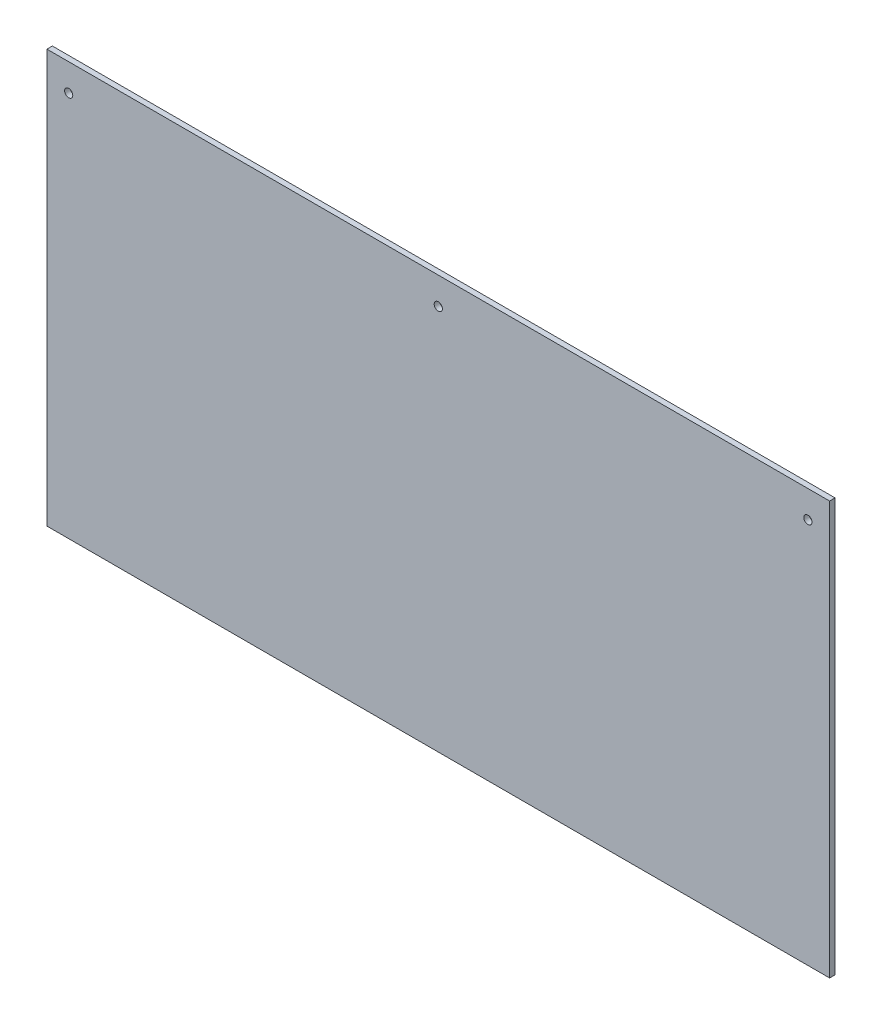
ISO-10303-21;
HEADER;
FILE_DESCRIPTION(('STEP AP214'),'2;1');
FILE_NAME('part.step','',(''),(''),'','','');
FILE_SCHEMA(('AUTOMOTIVE_DESIGN { 1 0 10303 214 1 1 1 1 }'));
ENDSEC;
DATA;
#1=APPLICATION_CONTEXT('core data for automotive mechanical design processes');
#2=APPLICATION_PROTOCOL_DEFINITION('international standard','automotive_design',2000,#1);
#3=PRODUCT_CONTEXT('',#1,'mechanical');
#4=PRODUCT('Part','Part','',(#3));
#5=PRODUCT_RELATED_PRODUCT_CATEGORY('part','',(#4));
#6=PRODUCT_DEFINITION_FORMATION('','',#4);
#7=PRODUCT_DEFINITION_CONTEXT('part definition',#1,'design');
#8=PRODUCT_DEFINITION('design','',#6,#7);
#9=PRODUCT_DEFINITION_SHAPE('','',#8);
#10=(LENGTH_UNIT() NAMED_UNIT(*) SI_UNIT(.MILLI.,.METRE.));
#11=(NAMED_UNIT(*) PLANE_ANGLE_UNIT() SI_UNIT($,.RADIAN.));
#12=(NAMED_UNIT(*) SI_UNIT($,.STERADIAN.) SOLID_ANGLE_UNIT());
#13=UNCERTAINTY_MEASURE_WITH_UNIT(LENGTH_MEASURE(1.E-05),#10,'distance_accuracy_value','');
#14=(GEOMETRIC_REPRESENTATION_CONTEXT(3) GLOBAL_UNCERTAINTY_ASSIGNED_CONTEXT((#13)) GLOBAL_UNIT_ASSIGNED_CONTEXT((#10,
#11,#12)) REPRESENTATION_CONTEXT('',''));
#15=CARTESIAN_POINT('',(0.,0.,0.));
#16=DIRECTION('',(0.,0.,1.));
#17=DIRECTION('',(1.,0.,0.));
#18=AXIS2_PLACEMENT_3D('',#15,#16,#17);
#19=CARTESIAN_POINT('',(889.,450.85,0.));
#20=DIRECTION('',(0.,0.,1.));
#21=DIRECTION('',(1.,0.,0.));
#22=AXIS2_PLACEMENT_3D('',#19,#20,#21);
#23=CYLINDRICAL_SURFACE('',#22,4.7625);
#24=CARTESIAN_POINT('',(889.,450.85,0.));
#25=DIRECTION('',(0.,0.,1.));
#26=DIRECTION('',(1.,0.,0.));
#27=AXIS2_PLACEMENT_3D('',#24,#25,#26);
#28=CIRCLE('',#27,4.7625);
#29=CARTESIAN_POINT('',(893.7625,450.85,0.));
#30=VERTEX_POINT('',#29);
#31=EDGE_CURVE('E41',#30,#30,#28,.T.);
#32=ORIENTED_EDGE('',*,*,#31,.F.);
#33=EDGE_LOOP('',(#32));
#34=FACE_BOUND('',#33,.T.);
#35=CARTESIAN_POINT('',(889.,450.85,6.35));
#36=DIRECTION('',(0.,0.,1.));
#37=DIRECTION('',(1.,0.,0.));
#38=AXIS2_PLACEMENT_3D('',#35,#36,#37);
#39=CIRCLE('',#38,4.7625);
#40=CARTESIAN_POINT('',(893.7625,450.85,6.35));
#41=VERTEX_POINT('',#40);
#42=EDGE_CURVE('E11',#41,#41,#39,.T.);
#43=ORIENTED_EDGE('',*,*,#42,.T.);
#44=EDGE_LOOP('',(#43));
#45=FACE_BOUND('',#44,.T.);
#46=ADVANCED_FACE('F33',(#34,#45),#23,.F.);
#47=CARTESIAN_POINT('',(0.,0.,6.35));
#48=DIRECTION('',(1.,0.,0.));
#49=DIRECTION('',(0.,0.,-1.));
#50=AXIS2_PLACEMENT_3D('',#47,#48,#49);
#51=PLANE('',#50);
#52=DIRECTION('',(0.,-1.,0.));
#53=VECTOR('',#52,1.);
#54=CARTESIAN_POINT('',(0.,0.,0.));
#55=LINE('',#54,#53);
#56=CARTESIAN_POINT('',(0.,482.6,0.));
#57=VERTEX_POINT('',#56);
#58=CARTESIAN_POINT('',(0.,0.,0.));
#59=VERTEX_POINT('',#58);
#60=EDGE_CURVE('E101',#57,#59,#55,.T.);
#61=ORIENTED_EDGE('',*,*,#60,.T.);
#62=DIRECTION('',(0.,0.,-1.));
#63=VECTOR('',#62,1.);
#64=CARTESIAN_POINT('',(0.,0.,6.35));
#65=LINE('',#64,#63);
#66=CARTESIAN_POINT('',(0.,0.,6.35));
#67=VERTEX_POINT('',#66);
#68=EDGE_CURVE('E92',#67,#59,#65,.T.);
#69=ORIENTED_EDGE('',*,*,#68,.F.);
#70=DIRECTION('',(0.,-1.,0.));
#71=VECTOR('',#70,1.);
#72=CARTESIAN_POINT('',(0.,0.,6.35));
#73=LINE('',#72,#71);
#74=CARTESIAN_POINT('',(0.,482.6,6.35));
#75=VERTEX_POINT('',#74);
#76=EDGE_CURVE('E86',#75,#67,#73,.T.);
#77=ORIENTED_EDGE('',*,*,#76,.F.);
#78=DIRECTION('',(0.,0.,-1.));
#79=VECTOR('',#78,1.);
#80=CARTESIAN_POINT('',(0.,482.6,6.35));
#81=LINE('',#80,#79);
#82=EDGE_CURVE('E97',#75,#57,#81,.T.);
#83=ORIENTED_EDGE('',*,*,#82,.T.);
#84=EDGE_LOOP('',(#61,#69,#77,#83));
#85=FACE_BOUND('',#84,.T.);
#86=ADVANCED_FACE('F117',(#85),#51,.F.);
#87=CARTESIAN_POINT('',(0.,0.,6.35));
#88=DIRECTION('',(0.,1.,0.));
#89=DIRECTION('',(0.,0.,1.));
#90=AXIS2_PLACEMENT_3D('',#87,#88,#89);
#91=PLANE('',#90);
#92=DIRECTION('',(1.,0.,0.));
#93=VECTOR('',#92,1.);
#94=CARTESIAN_POINT('',(0.,0.,0.));
#95=LINE('',#94,#93);
#96=CARTESIAN_POINT('',(914.4,0.,0.));
#97=VERTEX_POINT('',#96);
#98=EDGE_CURVE('E91',#59,#97,#95,.T.);
#99=ORIENTED_EDGE('',*,*,#98,.T.);
#100=DIRECTION('',(0.,0.,-1.));
#101=VECTOR('',#100,1.);
#102=CARTESIAN_POINT('',(914.4,0.,6.35));
#103=LINE('',#102,#101);
#104=CARTESIAN_POINT('',(914.4,0.,6.35));
#105=VERTEX_POINT('',#104);
#106=EDGE_CURVE('E89',#105,#97,#103,.T.);
#107=ORIENTED_EDGE('',*,*,#106,.F.);
#108=DIRECTION('',(1.,0.,0.));
#109=VECTOR('',#108,1.);
#110=CARTESIAN_POINT('',(0.,0.,6.35));
#111=LINE('',#110,#109);
#112=EDGE_CURVE('E80',#67,#105,#111,.T.);
#113=ORIENTED_EDGE('',*,*,#112,.F.);
#114=ORIENTED_EDGE('',*,*,#68,.T.);
#115=EDGE_LOOP('',(#99,#107,#113,#114));
#116=FACE_BOUND('',#115,.T.);
#117=ADVANCED_FACE('F90',(#116),#91,.F.);
#118=CARTESIAN_POINT('',(914.4,0.,6.35));
#119=DIRECTION('',(-1.,0.,0.));
#120=DIRECTION('',(0.,0.,1.));
#121=AXIS2_PLACEMENT_3D('',#118,#119,#120);
#122=PLANE('',#121);
#123=DIRECTION('',(0.,1.,0.));
#124=VECTOR('',#123,1.);
#125=CARTESIAN_POINT('',(914.4,0.,0.));
#126=LINE('',#125,#124);
#127=CARTESIAN_POINT('',(914.4,482.6,0.));
#128=VERTEX_POINT('',#127);
#129=EDGE_CURVE('E66',#97,#128,#126,.T.);
#130=ORIENTED_EDGE('',*,*,#129,.T.);
#131=DIRECTION('',(0.,0.,-1.));
#132=VECTOR('',#131,1.);
#133=CARTESIAN_POINT('',(914.4,482.6,6.35));
#134=LINE('',#133,#132);
#135=CARTESIAN_POINT('',(914.4,482.6,6.35));
#136=VERTEX_POINT('',#135);
#137=EDGE_CURVE('E93',#136,#128,#134,.T.);
#138=ORIENTED_EDGE('',*,*,#137,.F.);
#139=DIRECTION('',(0.,1.,0.));
#140=VECTOR('',#139,1.);
#141=CARTESIAN_POINT('',(914.4,0.,6.35));
#142=LINE('',#141,#140);
#143=EDGE_CURVE('E84',#105,#136,#142,.T.);
#144=ORIENTED_EDGE('',*,*,#143,.F.);
#145=ORIENTED_EDGE('',*,*,#106,.T.);
#146=EDGE_LOOP('',(#130,#138,#144,#145));
#147=FACE_BOUND('',#146,.T.);
#148=ADVANCED_FACE('F95',(#147),#122,.F.);
#149=CARTESIAN_POINT('',(0.,482.6,6.35));
#150=DIRECTION('',(0.,-1.,0.));
#151=DIRECTION('',(1.,0.,0.));
#152=AXIS2_PLACEMENT_3D('',#149,#150,#151);
#153=PLANE('',#152);
#154=DIRECTION('',(-1.,0.,0.));
#155=VECTOR('',#154,1.);
#156=CARTESIAN_POINT('',(0.,482.6,0.));
#157=LINE('',#156,#155);
#158=EDGE_CURVE('E72',#128,#57,#157,.T.);
#159=ORIENTED_EDGE('',*,*,#158,.T.);
#160=ORIENTED_EDGE('',*,*,#82,.F.);
#161=DIRECTION('',(-1.,0.,0.));
#162=VECTOR('',#161,1.);
#163=CARTESIAN_POINT('',(0.,482.6,6.35));
#164=LINE('',#163,#162);
#165=EDGE_CURVE('E49',#136,#75,#164,.T.);
#166=ORIENTED_EDGE('',*,*,#165,.F.);
#167=ORIENTED_EDGE('',*,*,#137,.T.);
#168=EDGE_LOOP('',(#159,#160,#166,#167));
#169=FACE_BOUND('',#168,.T.);
#170=ADVANCED_FACE('F120',(#169),#153,.F.);
#171=CARTESIAN_POINT('',(0.,0.,6.35));
#172=DIRECTION('',(0.,0.,-1.));
#173=DIRECTION('',(-1.,0.,0.));
#174=AXIS2_PLACEMENT_3D('',#171,#172,#173);
#175=PLANE('',#174);
#176=CARTESIAN_POINT('',(457.2,450.85,6.35));
#177=DIRECTION('',(0.,0.,1.));
#178=DIRECTION('',(1.,0.,0.));
#179=AXIS2_PLACEMENT_3D('',#176,#177,#178);
#180=CIRCLE('',#179,4.7625);
#181=CARTESIAN_POINT('',(461.9625,450.85,6.35));
#182=VERTEX_POINT('',#181);
#183=EDGE_CURVE('E149',#182,#182,#180,.T.);
#184=ORIENTED_EDGE('',*,*,#183,.F.);
#185=EDGE_LOOP('',(#184));
#186=FACE_BOUND('',#185,.T.);
#187=CARTESIAN_POINT('',(25.4,450.85,6.35));
#188=DIRECTION('',(0.,0.,1.));
#189=DIRECTION('',(1.,0.,0.));
#190=AXIS2_PLACEMENT_3D('',#187,#188,#189);
#191=CIRCLE('',#190,4.7625);
#192=CARTESIAN_POINT('',(30.1625,450.85,6.35));
#193=VERTEX_POINT('',#192);
#194=EDGE_CURVE('E146',#193,#193,#191,.T.);
#195=ORIENTED_EDGE('',*,*,#194,.F.);
#196=EDGE_LOOP('',(#195));
#197=FACE_BOUND('',#196,.T.);
#198=ORIENTED_EDGE('',*,*,#76,.T.);
#199=ORIENTED_EDGE('',*,*,#112,.T.);
#200=ORIENTED_EDGE('',*,*,#143,.T.);
#201=ORIENTED_EDGE('',*,*,#165,.T.);
#202=EDGE_LOOP('',(#198,#199,#200,#201));
#203=FACE_BOUND('',#202,.T.);
#204=ORIENTED_EDGE('',*,*,#42,.F.);
#205=EDGE_LOOP('',(#204));
#206=FACE_BOUND('',#205,.T.);
#207=ADVANCED_FACE('F81',(#186,#197,#203,#206),#175,.F.);
#208=CARTESIAN_POINT('',(0.,0.,0.));
#209=DIRECTION('',(0.,0.,-1.));
#210=DIRECTION('',(-1.,0.,0.));
#211=AXIS2_PLACEMENT_3D('',#208,#209,#210);
#212=PLANE('',#211);
#213=CARTESIAN_POINT('',(457.2,450.85,0.));
#214=DIRECTION('',(0.,0.,1.));
#215=DIRECTION('',(1.,0.,0.));
#216=AXIS2_PLACEMENT_3D('',#213,#214,#215);
#217=CIRCLE('',#216,4.7625);
#218=CARTESIAN_POINT('',(461.9625,450.85,0.));
#219=VERTEX_POINT('',#218);
#220=EDGE_CURVE('E154',#219,#219,#217,.T.);
#221=ORIENTED_EDGE('',*,*,#220,.T.);
#222=EDGE_LOOP('',(#221));
#223=FACE_BOUND('',#222,.T.);
#224=CARTESIAN_POINT('',(25.4,450.85,0.));
#225=DIRECTION('',(0.,0.,1.));
#226=DIRECTION('',(1.,0.,0.));
#227=AXIS2_PLACEMENT_3D('',#224,#225,#226);
#228=CIRCLE('',#227,4.7625);
#229=CARTESIAN_POINT('',(30.1625,450.85,0.));
#230=VERTEX_POINT('',#229);
#231=EDGE_CURVE('E104',#230,#230,#228,.T.);
#232=ORIENTED_EDGE('',*,*,#231,.T.);
#233=EDGE_LOOP('',(#232));
#234=FACE_BOUND('',#233,.T.);
#235=ORIENTED_EDGE('',*,*,#60,.F.);
#236=ORIENTED_EDGE('',*,*,#158,.F.);
#237=ORIENTED_EDGE('',*,*,#129,.F.);
#238=ORIENTED_EDGE('',*,*,#98,.F.);
#239=EDGE_LOOP('',(#235,#236,#237,#238));
#240=FACE_BOUND('',#239,.T.);
#241=ORIENTED_EDGE('',*,*,#31,.T.);
#242=EDGE_LOOP('',(#241));
#243=FACE_BOUND('',#242,.T.);
#244=ADVANCED_FACE('F113',(#223,#234,#240,#243),#212,.T.);
#245=CARTESIAN_POINT('',(25.4,450.85,0.));
#246=DIRECTION('',(0.,0.,1.));
#247=DIRECTION('',(1.,0.,0.));
#248=AXIS2_PLACEMENT_3D('',#245,#246,#247);
#249=CYLINDRICAL_SURFACE('',#248,4.7625);
#250=ORIENTED_EDGE('',*,*,#231,.F.);
#251=EDGE_LOOP('',(#250));
#252=FACE_BOUND('',#251,.T.);
#253=ORIENTED_EDGE('',*,*,#194,.T.);
#254=EDGE_LOOP('',(#253));
#255=FACE_BOUND('',#254,.T.);
#256=ADVANCED_FACE('F127',(#252,#255),#249,.F.);
#257=CARTESIAN_POINT('',(457.2,450.85,0.));
#258=DIRECTION('',(0.,0.,1.));
#259=DIRECTION('',(1.,0.,0.));
#260=AXIS2_PLACEMENT_3D('',#257,#258,#259);
#261=CYLINDRICAL_SURFACE('',#260,4.7625);
#262=ORIENTED_EDGE('',*,*,#220,.F.);
#263=EDGE_LOOP('',(#262));
#264=FACE_BOUND('',#263,.T.);
#265=ORIENTED_EDGE('',*,*,#183,.T.);
#266=EDGE_LOOP('',(#265));
#267=FACE_BOUND('',#266,.T.);
#268=ADVANCED_FACE('F159',(#264,#267),#261,.F.);
#269=CLOSED_SHELL('',(#46,#86,#117,#148,#170,#207,#244,#256,#268));
#270=MANIFOLD_SOLID_BREP('B2',#269);
#271=ADVANCED_BREP_SHAPE_REPRESENTATION('',(#18,#270),#14);
#272=SHAPE_DEFINITION_REPRESENTATION(#9,#271);
ENDSEC;
END-ISO-10303-21;
